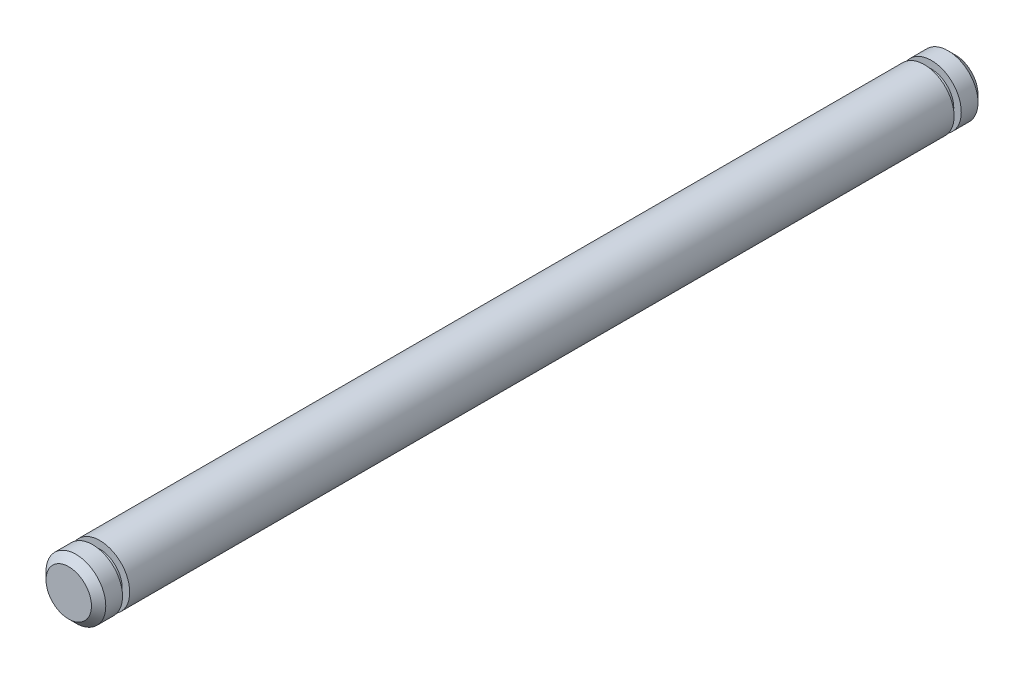
ISO-10303-21;
HEADER;
FILE_DESCRIPTION(('STEP AP214'),'2;1');
FILE_NAME('part.step','',(''),(''),'','','');
FILE_SCHEMA(('AUTOMOTIVE_DESIGN { 1 0 10303 214 1 1 1 1 }'));
ENDSEC;
DATA;
#1=APPLICATION_CONTEXT('core data for automotive mechanical design processes');
#2=APPLICATION_PROTOCOL_DEFINITION('international standard','automotive_design',2000,#1);
#3=PRODUCT_CONTEXT('',#1,'mechanical');
#4=PRODUCT('Part','Part','',(#3));
#5=PRODUCT_RELATED_PRODUCT_CATEGORY('part','',(#4));
#6=PRODUCT_DEFINITION_FORMATION('','',#4);
#7=PRODUCT_DEFINITION_CONTEXT('part definition',#1,'design');
#8=PRODUCT_DEFINITION('design','',#6,#7);
#9=PRODUCT_DEFINITION_SHAPE('','',#8);
#10=(LENGTH_UNIT() NAMED_UNIT(*) SI_UNIT(.MILLI.,.METRE.));
#11=(NAMED_UNIT(*) PLANE_ANGLE_UNIT() SI_UNIT($,.RADIAN.));
#12=(NAMED_UNIT(*) SI_UNIT($,.STERADIAN.) SOLID_ANGLE_UNIT());
#13=UNCERTAINTY_MEASURE_WITH_UNIT(LENGTH_MEASURE(1.E-05),#10,'distance_accuracy_value','');
#14=(GEOMETRIC_REPRESENTATION_CONTEXT(3) GLOBAL_UNCERTAINTY_ASSIGNED_CONTEXT((#13)) GLOBAL_UNIT_ASSIGNED_CONTEXT((#10,
#11,#12)) REPRESENTATION_CONTEXT('',''));
#15=CARTESIAN_POINT('',(0.,0.,0.));
#16=DIRECTION('',(0.,0.,1.));
#17=DIRECTION('',(1.,0.,0.));
#18=AXIS2_PLACEMENT_3D('',#15,#16,#17);
#19=CARTESIAN_POINT('',(0.,0.,21.89226));
#20=DIRECTION('',(0.,0.,-1.));
#21=DIRECTION('',(-1.,0.,0.));
#22=AXIS2_PLACEMENT_3D('',#19,#20,#21);
#23=CYLINDRICAL_SURFACE('',#22,1.5875);
#24=CARTESIAN_POINT('',(0.,0.,21.89226));
#25=DIRECTION('',(0.,0.,1.));
#26=DIRECTION('',(1.,0.,0.));
#27=AXIS2_PLACEMENT_3D('',#24,#25,#26);
#28=CIRCLE('',#27,1.5875);
#29=CARTESIAN_POINT('',(1.5875,0.,21.89226));
#30=VERTEX_POINT('',#29);
#31=EDGE_CURVE('E54',#30,#30,#28,.T.);
#32=ORIENTED_EDGE('',*,*,#31,.F.);
#33=EDGE_LOOP('',(#32));
#34=FACE_BOUND('',#33,.T.);
#35=CARTESIAN_POINT('',(0.,0.,-21.89226));
#36=DIRECTION('',(0.,0.,1.));
#37=DIRECTION('',(1.,0.,0.));
#38=AXIS2_PLACEMENT_3D('',#35,#36,#37);
#39=CIRCLE('',#38,1.5875);
#40=CARTESIAN_POINT('',(1.5875,0.,-21.89226));
#41=VERTEX_POINT('',#40);
#42=EDGE_CURVE('E51',#41,#41,#39,.T.);
#43=ORIENTED_EDGE('',*,*,#42,.T.);
#44=EDGE_LOOP('',(#43));
#45=FACE_BOUND('',#44,.T.);
#46=ADVANCED_FACE('F30',(#34,#45),#23,.T.);
#47=CARTESIAN_POINT('',(0.,0.,21.89226));
#48=DIRECTION('',(0.,0.,1.));
#49=DIRECTION('',(1.,0.,0.));
#50=AXIS2_PLACEMENT_3D('',#47,#48,#49);
#51=PLANE('',#50);
#52=CARTESIAN_POINT('',(0.,0.,21.89226));
#53=DIRECTION('',(0.,0.,1.));
#54=DIRECTION('',(1.,0.,0.));
#55=AXIS2_PLACEMENT_3D('',#52,#53,#54);
#56=CIRCLE('',#55,1.19126);
#57=CARTESIAN_POINT('',(1.19126,0.,21.89226));
#58=VERTEX_POINT('',#57);
#59=EDGE_CURVE('E50',#58,#58,#56,.T.);
#60=ORIENTED_EDGE('',*,*,#59,.F.);
#61=EDGE_LOOP('',(#60));
#62=FACE_BOUND('',#61,.T.);
#63=ORIENTED_EDGE('',*,*,#31,.T.);
#64=EDGE_LOOP('',(#63));
#65=FACE_BOUND('',#64,.T.);
#66=ADVANCED_FACE('F92',(#62,#65),#51,.T.);
#67=CARTESIAN_POINT('',(0.,0.,-21.89226));
#68=DIRECTION('',(0.,0.,1.));
#69=DIRECTION('',(1.,0.,0.));
#70=AXIS2_PLACEMENT_3D('',#67,#68,#69);
#71=PLANE('',#70);
#72=CARTESIAN_POINT('',(0.,0.,-21.89226));
#73=DIRECTION('',(0.,0.,1.));
#74=DIRECTION('',(1.,0.,0.));
#75=AXIS2_PLACEMENT_3D('',#72,#73,#74);
#76=CIRCLE('',#75,1.19126);
#77=CARTESIAN_POINT('',(1.19126,0.,-21.89226));
#78=VERTEX_POINT('',#77);
#79=EDGE_CURVE('E65',#78,#78,#76,.T.);
#80=ORIENTED_EDGE('',*,*,#79,.T.);
#81=EDGE_LOOP('',(#80));
#82=FACE_BOUND('',#81,.T.);
#83=ORIENTED_EDGE('',*,*,#42,.F.);
#84=EDGE_LOOP('',(#83));
#85=FACE_BOUND('',#84,.T.);
#86=ADVANCED_FACE('F98',(#82,#85),#71,.F.);
#87=CARTESIAN_POINT('',(0.,0.,22.27326));
#88=DIRECTION('',(0.,0.,-1.));
#89=DIRECTION('',(-1.,0.,0.));
#90=AXIS2_PLACEMENT_3D('',#87,#88,#89);
#91=CYLINDRICAL_SURFACE('',#90,1.19126);
#92=CARTESIAN_POINT('',(0.,0.,22.27326));
#93=DIRECTION('',(0.,0.,1.));
#94=DIRECTION('',(1.,0.,0.));
#95=AXIS2_PLACEMENT_3D('',#92,#93,#94);
#96=CIRCLE('',#95,1.19126);
#97=CARTESIAN_POINT('',(1.19126,0.,22.27326));
#98=VERTEX_POINT('',#97);
#99=EDGE_CURVE('E55',#98,#98,#96,.T.);
#100=ORIENTED_EDGE('',*,*,#99,.F.);
#101=EDGE_LOOP('',(#100));
#102=FACE_BOUND('',#101,.T.);
#103=ORIENTED_EDGE('',*,*,#59,.T.);
#104=EDGE_LOOP('',(#103));
#105=FACE_BOUND('',#104,.T.);
#106=ADVANCED_FACE('F123',(#102,#105),#91,.T.);
#107=CARTESIAN_POINT('',(0.,0.,23.54326));
#108=DIRECTION('',(0.,0.,-1.));
#109=DIRECTION('',(-1.,0.,0.));
#110=AXIS2_PLACEMENT_3D('',#107,#108,#109);
#111=CYLINDRICAL_SURFACE('',#110,1.5875);
#112=CARTESIAN_POINT('',(0.,0.,23.16226));
#113=DIRECTION('',(0.,0.,1.));
#114=DIRECTION('',(1.,0.,0.));
#115=AXIS2_PLACEMENT_3D('',#112,#113,#114);
#116=CIRCLE('',#115,1.5875);
#117=CARTESIAN_POINT('',(1.5875,0.,23.16226));
#118=VERTEX_POINT('',#117);
#119=EDGE_CURVE('E41',#118,#118,#116,.F.);
#120=ORIENTED_EDGE('',*,*,#119,.T.);
#121=EDGE_LOOP('',(#120));
#122=FACE_BOUND('',#121,.T.);
#123=CARTESIAN_POINT('',(0.,0.,22.27326));
#124=DIRECTION('',(0.,0.,1.));
#125=DIRECTION('',(1.,0.,0.));
#126=AXIS2_PLACEMENT_3D('',#123,#124,#125);
#127=CIRCLE('',#126,1.5875);
#128=CARTESIAN_POINT('',(1.5875,0.,22.27326));
#129=VERTEX_POINT('',#128);
#130=EDGE_CURVE('E62',#129,#129,#127,.T.);
#131=ORIENTED_EDGE('',*,*,#130,.T.);
#132=EDGE_LOOP('',(#131));
#133=FACE_BOUND('',#132,.T.);
#134=ADVANCED_FACE('F118',(#122,#133),#111,.T.);
#135=CARTESIAN_POINT('',(0.,0.,23.54326));
#136=DIRECTION('',(0.,0.,1.));
#137=DIRECTION('',(1.,0.,0.));
#138=AXIS2_PLACEMENT_3D('',#135,#136,#137);
#139=PLANE('',#138);
#140=CARTESIAN_POINT('',(0.,0.,23.54326));
#141=DIRECTION('',(0.,0.,1.));
#142=DIRECTION('',(1.,0.,0.));
#143=AXIS2_PLACEMENT_3D('',#140,#141,#142);
#144=CIRCLE('',#143,1.2065);
#145=CARTESIAN_POINT('',(1.2065,0.,23.54326));
#146=VERTEX_POINT('',#145);
#147=EDGE_CURVE('E45',#146,#146,#144,.T.);
#148=ORIENTED_EDGE('',*,*,#147,.T.);
#149=EDGE_LOOP('',(#148));
#150=FACE_BOUND('',#149,.T.);
#151=ADVANCED_FACE('F110',(#150),#139,.T.);
#152=CARTESIAN_POINT('',(0.,0.,22.27326));
#153=DIRECTION('',(0.,0.,1.));
#154=DIRECTION('',(1.,0.,0.));
#155=AXIS2_PLACEMENT_3D('',#152,#153,#154);
#156=PLANE('',#155);
#157=ORIENTED_EDGE('',*,*,#99,.T.);
#158=EDGE_LOOP('',(#157));
#159=FACE_BOUND('',#158,.T.);
#160=ORIENTED_EDGE('',*,*,#130,.F.);
#161=EDGE_LOOP('',(#160));
#162=FACE_BOUND('',#161,.T.);
#163=ADVANCED_FACE('F105',(#159,#162),#156,.F.);
#164=CARTESIAN_POINT('',(0.,0.,23.54326));
#165=DIRECTION('',(0.,0.,-1.));
#166=DIRECTION('',(-1.,0.,0.));
#167=AXIS2_PLACEMENT_3D('',#164,#165,#166);
#168=CONICAL_SURFACE('',#167,1.2065,0.785398163397446);
#169=ORIENTED_EDGE('',*,*,#119,.F.);
#170=EDGE_LOOP('',(#169));
#171=FACE_BOUND('',#170,.T.);
#172=ORIENTED_EDGE('',*,*,#147,.F.);
#173=EDGE_LOOP('',(#172));
#174=FACE_BOUND('',#173,.T.);
#175=ADVANCED_FACE('F87',(#171,#174),#168,.T.);
#176=CARTESIAN_POINT('',(0.,0.,-22.27326));
#177=DIRECTION('',(0.,0.,1.));
#178=DIRECTION('',(1.,0.,0.));
#179=AXIS2_PLACEMENT_3D('',#176,#177,#178);
#180=CYLINDRICAL_SURFACE('',#179,1.19126);
#181=CARTESIAN_POINT('',(0.,0.,-22.27326));
#182=DIRECTION('',(0.,0.,1.));
#183=DIRECTION('',(1.,0.,0.));
#184=AXIS2_PLACEMENT_3D('',#181,#182,#183);
#185=CIRCLE('',#184,1.19126);
#186=CARTESIAN_POINT('',(1.19126,0.,-22.27326));
#187=VERTEX_POINT('',#186);
#188=EDGE_CURVE('E68',#187,#187,#185,.T.);
#189=ORIENTED_EDGE('',*,*,#188,.T.);
#190=EDGE_LOOP('',(#189));
#191=FACE_BOUND('',#190,.T.);
#192=ORIENTED_EDGE('',*,*,#79,.F.);
#193=EDGE_LOOP('',(#192));
#194=FACE_BOUND('',#193,.T.);
#195=ADVANCED_FACE('F80',(#191,#194),#180,.T.);
#196=CARTESIAN_POINT('',(0.,0.,-23.54326));
#197=DIRECTION('',(0.,0.,1.));
#198=DIRECTION('',(1.,0.,0.));
#199=AXIS2_PLACEMENT_3D('',#196,#197,#198);
#200=CYLINDRICAL_SURFACE('',#199,1.5875);
#201=CARTESIAN_POINT('',(0.,0.,-23.16226));
#202=DIRECTION('',(0.,0.,-1.));
#203=DIRECTION('',(-1.,0.,0.));
#204=AXIS2_PLACEMENT_3D('',#201,#202,#203);
#205=CIRCLE('',#204,1.5875);
#206=CARTESIAN_POINT('',(-1.5875,0.,-23.16226));
#207=VERTEX_POINT('',#206);
#208=EDGE_CURVE('E37',#207,#207,#205,.F.);
#209=ORIENTED_EDGE('',*,*,#208,.T.);
#210=EDGE_LOOP('',(#209));
#211=FACE_BOUND('',#210,.T.);
#212=CARTESIAN_POINT('',(0.,0.,-22.27326));
#213=DIRECTION('',(0.,0.,1.));
#214=DIRECTION('',(1.,0.,0.));
#215=AXIS2_PLACEMENT_3D('',#212,#213,#214);
#216=CIRCLE('',#215,1.5875);
#217=CARTESIAN_POINT('',(1.5875,0.,-22.27326));
#218=VERTEX_POINT('',#217);
#219=EDGE_CURVE('E71',#218,#218,#216,.T.);
#220=ORIENTED_EDGE('',*,*,#219,.F.);
#221=EDGE_LOOP('',(#220));
#222=FACE_BOUND('',#221,.T.);
#223=ADVANCED_FACE('F77',(#211,#222),#200,.T.);
#224=CARTESIAN_POINT('',(0.,0.,-23.54326));
#225=DIRECTION('',(0.,0.,-1.));
#226=DIRECTION('',(1.,0.,0.));
#227=AXIS2_PLACEMENT_3D('',#224,#225,#226);
#228=PLANE('',#227);
#229=CARTESIAN_POINT('',(0.,0.,-23.54326));
#230=DIRECTION('',(0.,0.,-1.));
#231=DIRECTION('',(-1.,0.,0.));
#232=AXIS2_PLACEMENT_3D('',#229,#230,#231);
#233=CIRCLE('',#232,1.20649999999999);
#234=CARTESIAN_POINT('',(-1.20649999999999,0.,-23.54326));
#235=VERTEX_POINT('',#234);
#236=EDGE_CURVE('E10',#235,#235,#233,.T.);
#237=ORIENTED_EDGE('',*,*,#236,.T.);
#238=EDGE_LOOP('',(#237));
#239=FACE_BOUND('',#238,.T.);
#240=ADVANCED_FACE('F79',(#239),#228,.T.);
#241=CARTESIAN_POINT('',(0.,0.,-22.27326));
#242=DIRECTION('',(0.,0.,-1.));
#243=DIRECTION('',(1.,0.,0.));
#244=AXIS2_PLACEMENT_3D('',#241,#242,#243);
#245=PLANE('',#244);
#246=ORIENTED_EDGE('',*,*,#188,.F.);
#247=EDGE_LOOP('',(#246));
#248=FACE_BOUND('',#247,.T.);
#249=ORIENTED_EDGE('',*,*,#219,.T.);
#250=EDGE_LOOP('',(#249));
#251=FACE_BOUND('',#250,.T.);
#252=ADVANCED_FACE('F75',(#248,#251),#245,.F.);
#253=CARTESIAN_POINT('',(0.,0.,-23.16226));
#254=DIRECTION('',(0.,0.,1.));
#255=DIRECTION('',(1.,0.,0.));
#256=AXIS2_PLACEMENT_3D('',#253,#254,#255);
#257=CONICAL_SURFACE('',#256,1.5875,0.785398163397446);
#258=ORIENTED_EDGE('',*,*,#236,.F.);
#259=EDGE_LOOP('',(#258));
#260=FACE_BOUND('',#259,.T.);
#261=ORIENTED_EDGE('',*,*,#208,.F.);
#262=EDGE_LOOP('',(#261));
#263=FACE_BOUND('',#262,.T.);
#264=ADVANCED_FACE('F32',(#260,#263),#257,.T.);
#265=CLOSED_SHELL('',(#46,#66,#86,#106,#134,#151,#163,#175,#195,#223,#240,#252,#264));
#266=MANIFOLD_SOLID_BREP('B2',#265);
#267=ADVANCED_BREP_SHAPE_REPRESENTATION('',(#18,#266),#14);
#268=SHAPE_DEFINITION_REPRESENTATION(#9,#267);
ENDSEC;
END-ISO-10303-21;
